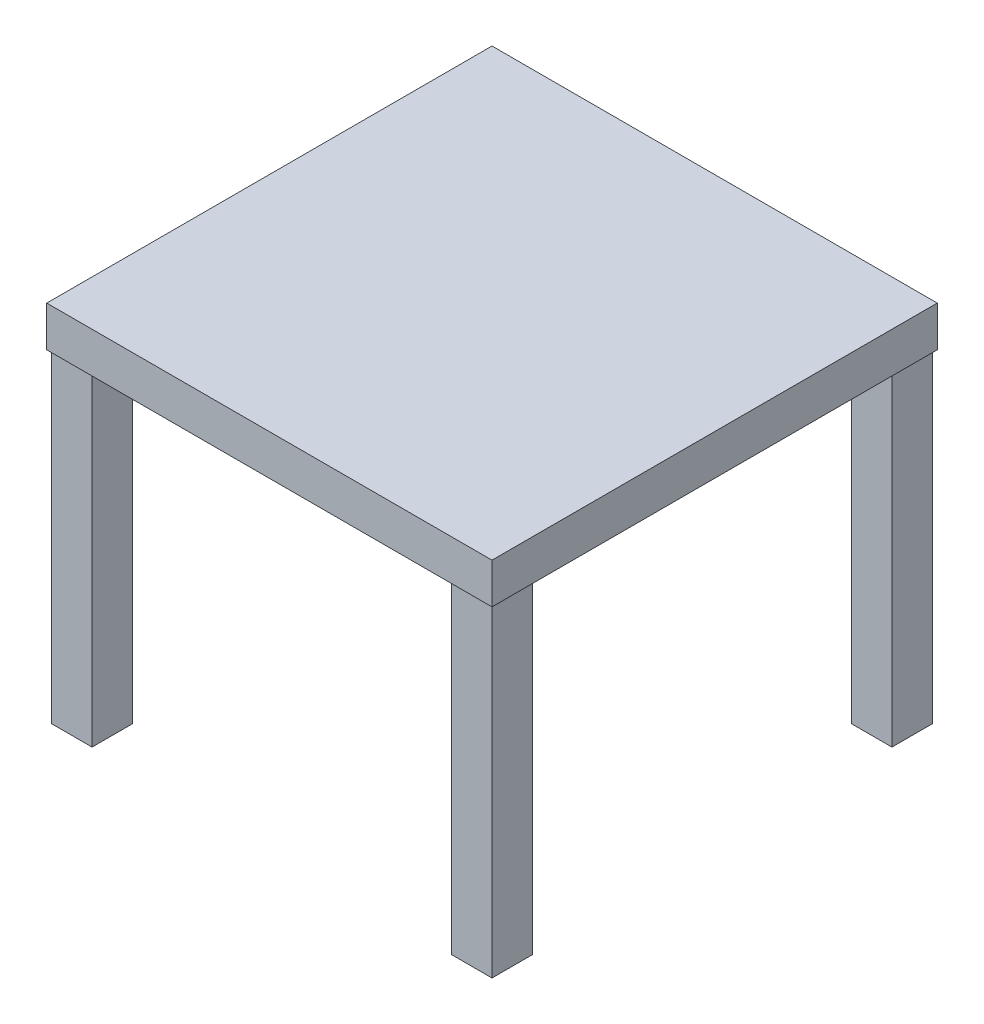
ISO-10303-21;
HEADER;
FILE_DESCRIPTION(('STEP AP214'),'2;1');
FILE_NAME('part.step','',(''),(''),'','','');
FILE_SCHEMA(('AUTOMOTIVE_DESIGN { 1 0 10303 214 1 1 1 1 }'));
ENDSEC;
DATA;
#1=APPLICATION_CONTEXT('core data for automotive mechanical design processes');
#2=APPLICATION_PROTOCOL_DEFINITION('international standard','automotive_design',2000,#1);
#3=PRODUCT_CONTEXT('',#1,'mechanical');
#4=PRODUCT('Part','Part','',(#3));
#5=PRODUCT_RELATED_PRODUCT_CATEGORY('part','',(#4));
#6=PRODUCT_DEFINITION_FORMATION('','',#4);
#7=PRODUCT_DEFINITION_CONTEXT('part definition',#1,'design');
#8=PRODUCT_DEFINITION('design','',#6,#7);
#9=PRODUCT_DEFINITION_SHAPE('','',#8);
#10=(LENGTH_UNIT() NAMED_UNIT(*) SI_UNIT(.MILLI.,.METRE.));
#11=(NAMED_UNIT(*) PLANE_ANGLE_UNIT() SI_UNIT($,.RADIAN.));
#12=(NAMED_UNIT(*) SI_UNIT($,.STERADIAN.) SOLID_ANGLE_UNIT());
#13=UNCERTAINTY_MEASURE_WITH_UNIT(LENGTH_MEASURE(1.E-05),#10,'distance_accuracy_value','');
#14=(GEOMETRIC_REPRESENTATION_CONTEXT(3) GLOBAL_UNCERTAINTY_ASSIGNED_CONTEXT((#13)) GLOBAL_UNIT_ASSIGNED_CONTEXT((#10,
#11,#12)) REPRESENTATION_CONTEXT('',''));
#15=CARTESIAN_POINT('',(0.,0.,0.));
#16=DIRECTION('',(0.,0.,1.));
#17=DIRECTION('',(1.,0.,0.));
#18=AXIS2_PLACEMENT_3D('',#15,#16,#17);
#19=CARTESIAN_POINT('',(-222.,0.,-222.));
#20=DIRECTION('',(0.,0.,1.));
#21=DIRECTION('',(1.,0.,0.));
#22=AXIS2_PLACEMENT_3D('',#19,#20,#21);
#23=PLANE('',#22);
#24=DIRECTION('',(1.,0.,0.));
#25=VECTOR('',#24,1.);
#26=CARTESIAN_POINT('',(-111.,0.,-222.));
#27=LINE('',#26,#25);
#28=CARTESIAN_POINT('',(-272.,0.,-222.));
#29=VERTEX_POINT('',#28);
#30=CARTESIAN_POINT('',(-222.,0.,-222.));
#31=VERTEX_POINT('',#30);
#32=EDGE_CURVE('E39',#29,#31,#27,.T.);
#33=ORIENTED_EDGE('',*,*,#32,.F.);
#34=DIRECTION('',(0.,-1.,0.));
#35=VECTOR('',#34,1.);
#36=CARTESIAN_POINT('',(-272.,0.,-222.));
#37=LINE('',#36,#35);
#38=CARTESIAN_POINT('',(-272.,-400.,-222.));
#39=VERTEX_POINT('',#38);
#40=EDGE_CURVE('E9',#29,#39,#37,.T.);
#41=ORIENTED_EDGE('',*,*,#40,.T.);
#42=DIRECTION('',(-1.,0.,0.));
#43=VECTOR('',#42,1.);
#44=CARTESIAN_POINT('',(-222.,-400.,-222.));
#45=LINE('',#44,#43);
#46=CARTESIAN_POINT('',(-222.,-400.,-222.));
#47=VERTEX_POINT('',#46);
#48=EDGE_CURVE('E306',#47,#39,#45,.T.);
#49=ORIENTED_EDGE('',*,*,#48,.F.);
#50=DIRECTION('',(0.,-1.,0.));
#51=VECTOR('',#50,1.);
#52=CARTESIAN_POINT('',(-222.,0.,-222.));
#53=LINE('',#52,#51);
#54=EDGE_CURVE('E26',#31,#47,#53,.T.);
#55=ORIENTED_EDGE('',*,*,#54,.F.);
#56=EDGE_LOOP('',(#33,#41,#49,#55));
#57=FACE_BOUND('',#56,.T.);
#58=ADVANCED_FACE('F15',(#57),#23,.T.);
#59=CARTESIAN_POINT('',(-222.,0.,-272.));
#60=DIRECTION('',(1.,0.,0.));
#61=DIRECTION('',(0.,1.,0.));
#62=AXIS2_PLACEMENT_3D('',#59,#60,#61);
#63=PLANE('',#62);
#64=DIRECTION('',(0.,0.,-1.));
#65=VECTOR('',#64,1.);
#66=CARTESIAN_POINT('',(-222.,0.,-136.));
#67=LINE('',#66,#65);
#68=CARTESIAN_POINT('',(-222.,0.,-272.));
#69=VERTEX_POINT('',#68);
#70=EDGE_CURVE('E271',#31,#69,#67,.T.);
#71=ORIENTED_EDGE('',*,*,#70,.F.);
#72=ORIENTED_EDGE('',*,*,#54,.T.);
#73=DIRECTION('',(0.,0.,1.));
#74=VECTOR('',#73,1.);
#75=CARTESIAN_POINT('',(-222.,-400.,-272.));
#76=LINE('',#75,#74);
#77=CARTESIAN_POINT('',(-222.,-400.,-272.));
#78=VERTEX_POINT('',#77);
#79=EDGE_CURVE('E301',#78,#47,#76,.T.);
#80=ORIENTED_EDGE('',*,*,#79,.F.);
#81=DIRECTION('',(0.,-1.,0.));
#82=VECTOR('',#81,1.);
#83=CARTESIAN_POINT('',(-222.,0.,-272.));
#84=LINE('',#83,#82);
#85=EDGE_CURVE('E256',#69,#78,#84,.T.);
#86=ORIENTED_EDGE('',*,*,#85,.F.);
#87=EDGE_LOOP('',(#71,#72,#80,#86));
#88=FACE_BOUND('',#87,.T.);
#89=ADVANCED_FACE('F445',(#88),#63,.T.);
#90=CARTESIAN_POINT('',(-272.,0.,-272.));
#91=DIRECTION('',(0.,0.,-1.));
#92=DIRECTION('',(0.,-1.,0.));
#93=AXIS2_PLACEMENT_3D('',#90,#91,#92);
#94=PLANE('',#93);
#95=DIRECTION('',(-1.,0.,0.));
#96=VECTOR('',#95,1.);
#97=CARTESIAN_POINT('',(-136.,0.,-272.));
#98=LINE('',#97,#96);
#99=CARTESIAN_POINT('',(-272.,0.,-272.));
#100=VERTEX_POINT('',#99);
#101=EDGE_CURVE('E349',#69,#100,#98,.T.);
#102=ORIENTED_EDGE('',*,*,#101,.F.);
#103=ORIENTED_EDGE('',*,*,#85,.T.);
#104=DIRECTION('',(1.,0.,0.));
#105=VECTOR('',#104,1.);
#106=CARTESIAN_POINT('',(-272.,-400.,-272.));
#107=LINE('',#106,#105);
#108=CARTESIAN_POINT('',(-272.,-400.,-272.));
#109=VERTEX_POINT('',#108);
#110=EDGE_CURVE('E305',#109,#78,#107,.T.);
#111=ORIENTED_EDGE('',*,*,#110,.F.);
#112=DIRECTION('',(0.,-1.,0.));
#113=VECTOR('',#112,1.);
#114=CARTESIAN_POINT('',(-272.,0.,-272.));
#115=LINE('',#114,#113);
#116=EDGE_CURVE('E260',#100,#109,#115,.T.);
#117=ORIENTED_EDGE('',*,*,#116,.F.);
#118=EDGE_LOOP('',(#102,#103,#111,#117));
#119=FACE_BOUND('',#118,.T.);
#120=ADVANCED_FACE('F450',(#119),#94,.T.);
#121=CARTESIAN_POINT('',(-272.,0.,-222.));
#122=DIRECTION('',(-1.,0.,0.));
#123=DIRECTION('',(0.,1.,0.));
#124=AXIS2_PLACEMENT_3D('',#121,#122,#123);
#125=PLANE('',#124);
#126=DIRECTION('',(0.,0.,1.));
#127=VECTOR('',#126,1.);
#128=CARTESIAN_POINT('',(-272.,0.,-111.));
#129=LINE('',#128,#127);
#130=EDGE_CURVE('E352',#100,#29,#129,.T.);
#131=ORIENTED_EDGE('',*,*,#130,.F.);
#132=ORIENTED_EDGE('',*,*,#116,.T.);
#133=DIRECTION('',(0.,0.,-1.));
#134=VECTOR('',#133,1.);
#135=CARTESIAN_POINT('',(-272.,-400.,-222.));
#136=LINE('',#135,#134);
#137=EDGE_CURVE('E361',#39,#109,#136,.T.);
#138=ORIENTED_EDGE('',*,*,#137,.F.);
#139=ORIENTED_EDGE('',*,*,#40,.F.);
#140=EDGE_LOOP('',(#131,#132,#138,#139));
#141=FACE_BOUND('',#140,.T.);
#142=ADVANCED_FACE('F490',(#141),#125,.T.);
#143=CARTESIAN_POINT('',(-247.,-400.,-247.));
#144=DIRECTION('',(0.,-1.,0.));
#145=DIRECTION('',(0.,0.,-1.));
#146=AXIS2_PLACEMENT_3D('',#143,#144,#145);
#147=PLANE('',#146);
#148=ORIENTED_EDGE('',*,*,#137,.T.);
#149=ORIENTED_EDGE('',*,*,#110,.T.);
#150=ORIENTED_EDGE('',*,*,#79,.T.);
#151=ORIENTED_EDGE('',*,*,#48,.T.);
#152=EDGE_LOOP('',(#148,#149,#150,#151));
#153=FACE_BOUND('',#152,.T.);
#154=ADVANCED_FACE('F495',(#153),#147,.T.);
#155=CARTESIAN_POINT('',(222.,0.,-222.));
#156=DIRECTION('',(-1.,0.,0.));
#157=DIRECTION('',(0.,0.,1.));
#158=AXIS2_PLACEMENT_3D('',#155,#156,#157);
#159=PLANE('',#158);
#160=DIRECTION('',(0.,0.,1.));
#161=VECTOR('',#160,1.);
#162=CARTESIAN_POINT('',(222.,0.,-111.));
#163=LINE('',#162,#161);
#164=CARTESIAN_POINT('',(222.,0.,-272.));
#165=VERTEX_POINT('',#164);
#166=CARTESIAN_POINT('',(222.,0.,-222.));
#167=VERTEX_POINT('',#166);
#168=EDGE_CURVE('E293',#165,#167,#163,.T.);
#169=ORIENTED_EDGE('',*,*,#168,.F.);
#170=DIRECTION('',(0.,-1.,0.));
#171=VECTOR('',#170,1.);
#172=CARTESIAN_POINT('',(222.,0.,-272.));
#173=LINE('',#172,#171);
#174=CARTESIAN_POINT('',(222.,-400.,-272.));
#175=VERTEX_POINT('',#174);
#176=EDGE_CURVE('E324',#165,#175,#173,.T.);
#177=ORIENTED_EDGE('',*,*,#176,.T.);
#178=DIRECTION('',(0.,0.,-1.));
#179=VECTOR('',#178,1.);
#180=CARTESIAN_POINT('',(222.,-400.,-222.));
#181=LINE('',#180,#179);
#182=CARTESIAN_POINT('',(222.,-400.,-222.));
#183=VERTEX_POINT('',#182);
#184=EDGE_CURVE('E279',#183,#175,#181,.T.);
#185=ORIENTED_EDGE('',*,*,#184,.F.);
#186=DIRECTION('',(0.,-1.,0.));
#187=VECTOR('',#186,1.);
#188=CARTESIAN_POINT('',(222.,0.,-222.));
#189=LINE('',#188,#187);
#190=EDGE_CURVE('E328',#167,#183,#189,.T.);
#191=ORIENTED_EDGE('',*,*,#190,.F.);
#192=EDGE_LOOP('',(#169,#177,#185,#191));
#193=FACE_BOUND('',#192,.T.);
#194=ADVANCED_FACE('F471',(#193),#159,.T.);
#195=CARTESIAN_POINT('',(272.,0.,-222.));
#196=DIRECTION('',(0.,0.,1.));
#197=DIRECTION('',(1.,0.,0.));
#198=AXIS2_PLACEMENT_3D('',#195,#196,#197);
#199=PLANE('',#198);
#200=DIRECTION('',(1.,0.,0.));
#201=VECTOR('',#200,1.);
#202=CARTESIAN_POINT('',(136.,0.,-222.));
#203=LINE('',#202,#201);
#204=CARTESIAN_POINT('',(272.,0.,-222.));
#205=VERTEX_POINT('',#204);
#206=EDGE_CURVE('E290',#167,#205,#203,.T.);
#207=ORIENTED_EDGE('',*,*,#206,.F.);
#208=ORIENTED_EDGE('',*,*,#190,.T.);
#209=DIRECTION('',(-1.,0.,0.));
#210=VECTOR('',#209,1.);
#211=CARTESIAN_POINT('',(272.,-400.,-222.));
#212=LINE('',#211,#210);
#213=CARTESIAN_POINT('',(272.,-400.,-222.));
#214=VERTEX_POINT('',#213);
#215=EDGE_CURVE('E275',#214,#183,#212,.T.);
#216=ORIENTED_EDGE('',*,*,#215,.F.);
#217=DIRECTION('',(0.,-1.,0.));
#218=VECTOR('',#217,1.);
#219=CARTESIAN_POINT('',(272.,0.,-222.));
#220=LINE('',#219,#218);
#221=EDGE_CURVE('E297',#205,#214,#220,.T.);
#222=ORIENTED_EDGE('',*,*,#221,.F.);
#223=EDGE_LOOP('',(#207,#208,#216,#222));
#224=FACE_BOUND('',#223,.T.);
#225=ADVANCED_FACE('F501',(#224),#199,.T.);
#226=CARTESIAN_POINT('',(272.,0.,-272.));
#227=DIRECTION('',(1.,0.,0.));
#228=DIRECTION('',(0.,1.,0.));
#229=AXIS2_PLACEMENT_3D('',#226,#227,#228);
#230=PLANE('',#229);
#231=DIRECTION('',(0.,0.,-1.));
#232=VECTOR('',#231,1.);
#233=CARTESIAN_POINT('',(272.,0.,-136.));
#234=LINE('',#233,#232);
#235=CARTESIAN_POINT('',(272.,0.,-272.));
#236=VERTEX_POINT('',#235);
#237=EDGE_CURVE('E268',#205,#236,#234,.T.);
#238=ORIENTED_EDGE('',*,*,#237,.F.);
#239=ORIENTED_EDGE('',*,*,#221,.T.);
#240=DIRECTION('',(0.,0.,1.));
#241=VECTOR('',#240,1.);
#242=CARTESIAN_POINT('',(272.,-400.,-272.));
#243=LINE('',#242,#241);
#244=CARTESIAN_POINT('',(272.,-400.,-272.));
#245=VERTEX_POINT('',#244);
#246=EDGE_CURVE('E250',#245,#214,#243,.T.);
#247=ORIENTED_EDGE('',*,*,#246,.F.);
#248=DIRECTION('',(0.,-1.,0.));
#249=VECTOR('',#248,1.);
#250=CARTESIAN_POINT('',(272.,0.,-272.));
#251=LINE('',#250,#249);
#252=EDGE_CURVE('E249',#236,#245,#251,.T.);
#253=ORIENTED_EDGE('',*,*,#252,.F.);
#254=EDGE_LOOP('',(#238,#239,#247,#253));
#255=FACE_BOUND('',#254,.T.);
#256=ADVANCED_FACE('F498',(#255),#230,.T.);
#257=CARTESIAN_POINT('',(222.,0.,-272.));
#258=DIRECTION('',(0.,0.,-1.));
#259=DIRECTION('',(-1.,0.,0.));
#260=AXIS2_PLACEMENT_3D('',#257,#258,#259);
#261=PLANE('',#260);
#262=DIRECTION('',(-1.,0.,0.));
#263=VECTOR('',#262,1.);
#264=CARTESIAN_POINT('',(111.,0.,-272.));
#265=LINE('',#264,#263);
#266=EDGE_CURVE('E264',#236,#165,#265,.T.);
#267=ORIENTED_EDGE('',*,*,#266,.F.);
#268=ORIENTED_EDGE('',*,*,#252,.T.);
#269=DIRECTION('',(1.,0.,0.));
#270=VECTOR('',#269,1.);
#271=CARTESIAN_POINT('',(222.,-400.,-272.));
#272=LINE('',#271,#270);
#273=EDGE_CURVE('E245',#175,#245,#272,.T.);
#274=ORIENTED_EDGE('',*,*,#273,.F.);
#275=ORIENTED_EDGE('',*,*,#176,.F.);
#276=EDGE_LOOP('',(#267,#268,#274,#275));
#277=FACE_BOUND('',#276,.T.);
#278=ADVANCED_FACE('F500',(#277),#261,.T.);
#279=CARTESIAN_POINT('',(247.,-400.,-247.));
#280=DIRECTION('',(0.,-1.,0.));
#281=DIRECTION('',(0.,0.,-1.));
#282=AXIS2_PLACEMENT_3D('',#279,#280,#281);
#283=PLANE('',#282);
#284=ORIENTED_EDGE('',*,*,#273,.T.);
#285=ORIENTED_EDGE('',*,*,#246,.T.);
#286=ORIENTED_EDGE('',*,*,#215,.T.);
#287=ORIENTED_EDGE('',*,*,#184,.T.);
#288=EDGE_LOOP('',(#284,#285,#286,#287));
#289=FACE_BOUND('',#288,.T.);
#290=ADVANCED_FACE('F507',(#289),#283,.T.);
#291=CARTESIAN_POINT('',(-222.,0.,222.));
#292=DIRECTION('',(1.,0.,0.));
#293=DIRECTION('',(0.,0.,1.));
#294=AXIS2_PLACEMENT_3D('',#291,#292,#293);
#295=PLANE('',#294);
#296=DIRECTION('',(0.,0.,-1.));
#297=VECTOR('',#296,1.);
#298=CARTESIAN_POINT('',(-222.,0.,111.));
#299=LINE('',#298,#297);
#300=CARTESIAN_POINT('',(-222.,0.,272.));
#301=VERTEX_POINT('',#300);
#302=CARTESIAN_POINT('',(-222.,0.,222.));
#303=VERTEX_POINT('',#302);
#304=EDGE_CURVE('E261',#301,#303,#299,.T.);
#305=ORIENTED_EDGE('',*,*,#304,.F.);
#306=DIRECTION('',(0.,-1.,0.));
#307=VECTOR('',#306,1.);
#308=CARTESIAN_POINT('',(-222.,0.,272.));
#309=LINE('',#308,#307);
#310=CARTESIAN_POINT('',(-222.,-400.,272.));
#311=VERTEX_POINT('',#310);
#312=EDGE_CURVE('E234',#301,#311,#309,.T.);
#313=ORIENTED_EDGE('',*,*,#312,.T.);
#314=DIRECTION('',(0.,0.,1.));
#315=VECTOR('',#314,1.);
#316=CARTESIAN_POINT('',(-222.,-400.,222.));
#317=LINE('',#316,#315);
#318=CARTESIAN_POINT('',(-222.,-400.,222.));
#319=VERTEX_POINT('',#318);
#320=EDGE_CURVE('E241',#319,#311,#317,.T.);
#321=ORIENTED_EDGE('',*,*,#320,.F.);
#322=DIRECTION('',(0.,-1.,0.));
#323=VECTOR('',#322,1.);
#324=CARTESIAN_POINT('',(-222.,0.,222.));
#325=LINE('',#324,#323);
#326=EDGE_CURVE('E230',#303,#319,#325,.T.);
#327=ORIENTED_EDGE('',*,*,#326,.F.);
#328=EDGE_LOOP('',(#305,#313,#321,#327));
#329=FACE_BOUND('',#328,.T.);
#330=ADVANCED_FACE('F564',(#329),#295,.T.);
#331=CARTESIAN_POINT('',(-272.,0.,222.));
#332=DIRECTION('',(0.,0.,-1.));
#333=DIRECTION('',(-1.,0.,0.));
#334=AXIS2_PLACEMENT_3D('',#331,#332,#333);
#335=PLANE('',#334);
#336=DIRECTION('',(-1.,0.,0.));
#337=VECTOR('',#336,1.);
#338=CARTESIAN_POINT('',(-136.,0.,222.));
#339=LINE('',#338,#337);
#340=CARTESIAN_POINT('',(-272.,0.,222.));
#341=VERTEX_POINT('',#340);
#342=EDGE_CURVE('E254',#303,#341,#339,.T.);
#343=ORIENTED_EDGE('',*,*,#342,.F.);
#344=ORIENTED_EDGE('',*,*,#326,.T.);
#345=DIRECTION('',(1.,0.,0.));
#346=VECTOR('',#345,1.);
#347=CARTESIAN_POINT('',(-272.,-400.,222.));
#348=LINE('',#347,#346);
#349=CARTESIAN_POINT('',(-272.,-400.,222.));
#350=VERTEX_POINT('',#349);
#351=EDGE_CURVE('E244',#350,#319,#348,.T.);
#352=ORIENTED_EDGE('',*,*,#351,.F.);
#353=DIRECTION('',(0.,-1.,0.));
#354=VECTOR('',#353,1.);
#355=CARTESIAN_POINT('',(-272.,0.,222.));
#356=LINE('',#355,#354);
#357=EDGE_CURVE('E235',#341,#350,#356,.T.);
#358=ORIENTED_EDGE('',*,*,#357,.F.);
#359=EDGE_LOOP('',(#343,#344,#352,#358));
#360=FACE_BOUND('',#359,.T.);
#361=ADVANCED_FACE('F573',(#360),#335,.T.);
#362=CARTESIAN_POINT('',(-272.,0.,272.));
#363=DIRECTION('',(-1.,0.,0.));
#364=DIRECTION('',(0.,0.,1.));
#365=AXIS2_PLACEMENT_3D('',#362,#363,#364);
#366=PLANE('',#365);
#367=DIRECTION('',(0.,0.,1.));
#368=VECTOR('',#367,1.);
#369=CARTESIAN_POINT('',(-272.,0.,136.));
#370=LINE('',#369,#368);
#371=CARTESIAN_POINT('',(-272.,0.,272.));
#372=VERTEX_POINT('',#371);
#373=EDGE_CURVE('E251',#341,#372,#370,.T.);
#374=ORIENTED_EDGE('',*,*,#373,.F.);
#375=ORIENTED_EDGE('',*,*,#357,.T.);
#376=DIRECTION('',(0.,0.,-1.));
#377=VECTOR('',#376,1.);
#378=CARTESIAN_POINT('',(-272.,-400.,272.));
#379=LINE('',#378,#377);
#380=CARTESIAN_POINT('',(-272.,-400.,272.));
#381=VERTEX_POINT('',#380);
#382=EDGE_CURVE('E312',#381,#350,#379,.T.);
#383=ORIENTED_EDGE('',*,*,#382,.F.);
#384=DIRECTION('',(0.,-1.,0.));
#385=VECTOR('',#384,1.);
#386=CARTESIAN_POINT('',(-272.,0.,272.));
#387=LINE('',#386,#385);
#388=EDGE_CURVE('E311',#372,#381,#387,.T.);
#389=ORIENTED_EDGE('',*,*,#388,.F.);
#390=EDGE_LOOP('',(#374,#375,#383,#389));
#391=FACE_BOUND('',#390,.T.);
#392=ADVANCED_FACE('F454',(#391),#366,.T.);
#393=CARTESIAN_POINT('',(-222.,0.,272.));
#394=DIRECTION('',(0.,0.,1.));
#395=DIRECTION('',(1.,0.,0.));
#396=AXIS2_PLACEMENT_3D('',#393,#394,#395);
#397=PLANE('',#396);
#398=DIRECTION('',(1.,0.,0.));
#399=VECTOR('',#398,1.);
#400=CARTESIAN_POINT('',(-111.,0.,272.));
#401=LINE('',#400,#399);
#402=EDGE_CURVE('E255',#372,#301,#401,.T.);
#403=ORIENTED_EDGE('',*,*,#402,.F.);
#404=ORIENTED_EDGE('',*,*,#388,.T.);
#405=DIRECTION('',(-1.,0.,0.));
#406=VECTOR('',#405,1.);
#407=CARTESIAN_POINT('',(-222.,-400.,272.));
#408=LINE('',#407,#406);
#409=EDGE_CURVE('E307',#311,#381,#408,.T.);
#410=ORIENTED_EDGE('',*,*,#409,.F.);
#411=ORIENTED_EDGE('',*,*,#312,.F.);
#412=EDGE_LOOP('',(#403,#404,#410,#411));
#413=FACE_BOUND('',#412,.T.);
#414=ADVANCED_FACE('F467',(#413),#397,.T.);
#415=CARTESIAN_POINT('',(-247.,-400.,247.));
#416=DIRECTION('',(0.,-1.,0.));
#417=DIRECTION('',(0.,0.,-1.));
#418=AXIS2_PLACEMENT_3D('',#415,#416,#417);
#419=PLANE('',#418);
#420=ORIENTED_EDGE('',*,*,#409,.T.);
#421=ORIENTED_EDGE('',*,*,#382,.T.);
#422=ORIENTED_EDGE('',*,*,#351,.T.);
#423=ORIENTED_EDGE('',*,*,#320,.T.);
#424=EDGE_LOOP('',(#420,#421,#422,#423));
#425=FACE_BOUND('',#424,.T.);
#426=ADVANCED_FACE('F462',(#425),#419,.T.);
#427=CARTESIAN_POINT('',(222.,0.,222.));
#428=DIRECTION('',(0.,0.,-1.));
#429=DIRECTION('',(0.,-1.,0.));
#430=AXIS2_PLACEMENT_3D('',#427,#428,#429);
#431=PLANE('',#430);
#432=DIRECTION('',(-1.,0.,0.));
#433=VECTOR('',#432,1.);
#434=CARTESIAN_POINT('',(111.,0.,222.));
#435=LINE('',#434,#433);
#436=CARTESIAN_POINT('',(272.,0.,222.));
#437=VERTEX_POINT('',#436);
#438=CARTESIAN_POINT('',(222.,0.,222.));
#439=VERTEX_POINT('',#438);
#440=EDGE_CURVE('E239',#437,#439,#435,.T.);
#441=ORIENTED_EDGE('',*,*,#440,.F.);
#442=DIRECTION('',(0.,-1.,0.));
#443=VECTOR('',#442,1.);
#444=CARTESIAN_POINT('',(272.,0.,222.));
#445=LINE('',#444,#443);
#446=CARTESIAN_POINT('',(272.,-400.,222.));
#447=VERTEX_POINT('',#446);
#448=EDGE_CURVE('E19',#437,#447,#445,.T.);
#449=ORIENTED_EDGE('',*,*,#448,.T.);
#450=DIRECTION('',(1.,0.,0.));
#451=VECTOR('',#450,1.);
#452=CARTESIAN_POINT('',(222.,-400.,222.));
#453=LINE('',#452,#451);
#454=CARTESIAN_POINT('',(222.,-400.,222.));
#455=VERTEX_POINT('',#454);
#456=EDGE_CURVE('E212',#455,#447,#453,.T.);
#457=ORIENTED_EDGE('',*,*,#456,.F.);
#458=DIRECTION('',(0.,-1.,0.));
#459=VECTOR('',#458,1.);
#460=CARTESIAN_POINT('',(222.,0.,222.));
#461=LINE('',#460,#459);
#462=EDGE_CURVE('E338',#439,#455,#461,.T.);
#463=ORIENTED_EDGE('',*,*,#462,.F.);
#464=EDGE_LOOP('',(#441,#449,#457,#463));
#465=FACE_BOUND('',#464,.T.);
#466=ADVANCED_FACE('F421',(#465),#431,.T.);
#467=CARTESIAN_POINT('',(222.,0.,272.));
#468=DIRECTION('',(-1.,0.,0.));
#469=DIRECTION('',(0.,1.,0.));
#470=AXIS2_PLACEMENT_3D('',#467,#468,#469);
#471=PLANE('',#470);
#472=DIRECTION('',(0.,0.,1.));
#473=VECTOR('',#472,1.);
#474=CARTESIAN_POINT('',(222.,0.,136.));
#475=LINE('',#474,#473);
#476=CARTESIAN_POINT('',(222.,0.,272.));
#477=VERTEX_POINT('',#476);
#478=EDGE_CURVE('E236',#439,#477,#475,.T.);
#479=ORIENTED_EDGE('',*,*,#478,.F.);
#480=ORIENTED_EDGE('',*,*,#462,.T.);
#481=DIRECTION('',(0.,0.,-1.));
#482=VECTOR('',#481,1.);
#483=CARTESIAN_POINT('',(222.,-400.,272.));
#484=LINE('',#483,#482);
#485=CARTESIAN_POINT('',(222.,-400.,272.));
#486=VERTEX_POINT('',#485);
#487=EDGE_CURVE('E348',#486,#455,#484,.T.);
#488=ORIENTED_EDGE('',*,*,#487,.F.);
#489=DIRECTION('',(0.,-1.,0.));
#490=VECTOR('',#489,1.);
#491=CARTESIAN_POINT('',(222.,0.,272.));
#492=LINE('',#491,#490);
#493=EDGE_CURVE('E334',#477,#486,#492,.T.);
#494=ORIENTED_EDGE('',*,*,#493,.F.);
#495=EDGE_LOOP('',(#479,#480,#488,#494));
#496=FACE_BOUND('',#495,.T.);
#497=ADVANCED_FACE('F432',(#496),#471,.T.);
#498=CARTESIAN_POINT('',(272.,0.,272.));
#499=DIRECTION('',(0.,0.,1.));
#500=DIRECTION('',(1.,0.,0.));
#501=AXIS2_PLACEMENT_3D('',#498,#499,#500);
#502=PLANE('',#501);
#503=DIRECTION('',(1.,0.,0.));
#504=VECTOR('',#503,1.);
#505=CARTESIAN_POINT('',(136.,0.,272.));
#506=LINE('',#505,#504);
#507=CARTESIAN_POINT('',(272.,0.,272.));
#508=VERTEX_POINT('',#507);
#509=EDGE_CURVE('E240',#477,#508,#506,.T.);
#510=ORIENTED_EDGE('',*,*,#509,.F.);
#511=ORIENTED_EDGE('',*,*,#493,.T.);
#512=DIRECTION('',(-1.,0.,0.));
#513=VECTOR('',#512,1.);
#514=CARTESIAN_POINT('',(272.,-400.,272.));
#515=LINE('',#514,#513);
#516=CARTESIAN_POINT('',(272.,-400.,272.));
#517=VERTEX_POINT('',#516);
#518=EDGE_CURVE('E344',#517,#486,#515,.T.);
#519=ORIENTED_EDGE('',*,*,#518,.F.);
#520=DIRECTION('',(0.,-1.,0.));
#521=VECTOR('',#520,1.);
#522=CARTESIAN_POINT('',(272.,0.,272.));
#523=LINE('',#522,#521);
#524=EDGE_CURVE('E339',#508,#517,#523,.T.);
#525=ORIENTED_EDGE('',*,*,#524,.F.);
#526=EDGE_LOOP('',(#510,#511,#519,#525));
#527=FACE_BOUND('',#526,.T.);
#528=ADVANCED_FACE('F428',(#527),#502,.T.);
#529=CARTESIAN_POINT('',(272.,0.,222.));
#530=DIRECTION('',(1.,0.,0.));
#531=DIRECTION('',(0.,0.,-1.));
#532=AXIS2_PLACEMENT_3D('',#529,#530,#531);
#533=PLANE('',#532);
#534=DIRECTION('',(0.,0.,-1.));
#535=VECTOR('',#534,1.);
#536=CARTESIAN_POINT('',(272.,0.,111.));
#537=LINE('',#536,#535);
#538=EDGE_CURVE('E323',#508,#437,#537,.T.);
#539=ORIENTED_EDGE('',*,*,#538,.F.);
#540=ORIENTED_EDGE('',*,*,#524,.T.);
#541=DIRECTION('',(0.,0.,1.));
#542=VECTOR('',#541,1.);
#543=CARTESIAN_POINT('',(272.,-400.,222.));
#544=LINE('',#543,#542);
#545=EDGE_CURVE('E343',#447,#517,#544,.T.);
#546=ORIENTED_EDGE('',*,*,#545,.F.);
#547=ORIENTED_EDGE('',*,*,#448,.F.);
#548=EDGE_LOOP('',(#539,#540,#546,#547));
#549=FACE_BOUND('',#548,.T.);
#550=ADVANCED_FACE('F424',(#549),#533,.T.);
#551=CARTESIAN_POINT('',(247.,-400.,247.));
#552=DIRECTION('',(0.,-1.,0.));
#553=DIRECTION('',(0.,0.,-1.));
#554=AXIS2_PLACEMENT_3D('',#551,#552,#553);
#555=PLANE('',#554);
#556=ORIENTED_EDGE('',*,*,#545,.T.);
#557=ORIENTED_EDGE('',*,*,#518,.T.);
#558=ORIENTED_EDGE('',*,*,#487,.T.);
#559=ORIENTED_EDGE('',*,*,#456,.T.);
#560=EDGE_LOOP('',(#556,#557,#558,#559));
#561=FACE_BOUND('',#560,.T.);
#562=ADVANCED_FACE('F416',(#561),#555,.T.);
#563=CARTESIAN_POINT('',(275.,0.,275.));
#564=DIRECTION('',(1.,0.,0.));
#565=DIRECTION('',(0.,1.,0.));
#566=AXIS2_PLACEMENT_3D('',#563,#564,#565);
#567=PLANE('',#566);
#568=DIRECTION('',(0.,0.,1.));
#569=VECTOR('',#568,1.);
#570=CARTESIAN_POINT('',(275.,0.,-275.));
#571=LINE('',#570,#569);
#572=CARTESIAN_POINT('',(275.,0.,-275.));
#573=VERTEX_POINT('',#572);
#574=CARTESIAN_POINT('',(275.,0.,275.));
#575=VERTEX_POINT('',#574);
#576=EDGE_CURVE('E191',#573,#575,#571,.T.);
#577=ORIENTED_EDGE('',*,*,#576,.F.);
#578=DIRECTION('',(0.,1.,0.));
#579=VECTOR('',#578,1.);
#580=CARTESIAN_POINT('',(275.,0.,-275.));
#581=LINE('',#580,#579);
#582=CARTESIAN_POINT('',(275.,50.,-275.));
#583=VERTEX_POINT('',#582);
#584=EDGE_CURVE('E194',#573,#583,#581,.T.);
#585=ORIENTED_EDGE('',*,*,#584,.T.);
#586=DIRECTION('',(0.,0.,-1.));
#587=VECTOR('',#586,1.);
#588=CARTESIAN_POINT('',(275.,50.,-275.));
#589=LINE('',#588,#587);
#590=CARTESIAN_POINT('',(275.,50.,275.));
#591=VERTEX_POINT('',#590);
#592=EDGE_CURVE('E184',#591,#583,#589,.T.);
#593=ORIENTED_EDGE('',*,*,#592,.F.);
#594=DIRECTION('',(0.,1.,0.));
#595=VECTOR('',#594,1.);
#596=CARTESIAN_POINT('',(275.,0.,275.));
#597=LINE('',#596,#595);
#598=EDGE_CURVE('E197',#575,#591,#597,.T.);
#599=ORIENTED_EDGE('',*,*,#598,.F.);
#600=EDGE_LOOP('',(#577,#585,#593,#599));
#601=FACE_BOUND('',#600,.T.);
#602=ADVANCED_FACE('F193',(#601),#567,.T.);
#603=CARTESIAN_POINT('',(-275.,0.,275.));
#604=DIRECTION('',(0.,0.,1.));
#605=DIRECTION('',(1.,0.,0.));
#606=AXIS2_PLACEMENT_3D('',#603,#604,#605);
#607=PLANE('',#606);
#608=DIRECTION('',(-1.,0.,0.));
#609=VECTOR('',#608,1.);
#610=CARTESIAN_POINT('',(275.,0.,275.));
#611=LINE('',#610,#609);
#612=CARTESIAN_POINT('',(-275.,0.,275.));
#613=VERTEX_POINT('',#612);
#614=EDGE_CURVE('E204',#575,#613,#611,.T.);
#615=ORIENTED_EDGE('',*,*,#614,.F.);
#616=ORIENTED_EDGE('',*,*,#598,.T.);
#617=DIRECTION('',(1.,0.,0.));
#618=VECTOR('',#617,1.);
#619=CARTESIAN_POINT('',(275.,50.,275.));
#620=LINE('',#619,#618);
#621=CARTESIAN_POINT('',(-275.,50.,275.));
#622=VERTEX_POINT('',#621);
#623=EDGE_CURVE('E225',#622,#591,#620,.T.);
#624=ORIENTED_EDGE('',*,*,#623,.F.);
#625=DIRECTION('',(0.,1.,0.));
#626=VECTOR('',#625,1.);
#627=CARTESIAN_POINT('',(-275.,0.,275.));
#628=LINE('',#627,#626);
#629=EDGE_CURVE('E274',#613,#622,#628,.T.);
#630=ORIENTED_EDGE('',*,*,#629,.F.);
#631=EDGE_LOOP('',(#615,#616,#624,#630));
#632=FACE_BOUND('',#631,.T.);
#633=ADVANCED_FACE('F17',(#632),#607,.T.);
#634=CARTESIAN_POINT('',(-275.,0.,-275.));
#635=DIRECTION('',(-1.,0.,0.));
#636=DIRECTION('',(0.,0.,1.));
#637=AXIS2_PLACEMENT_3D('',#634,#635,#636);
#638=PLANE('',#637);
#639=DIRECTION('',(0.,0.,-1.));
#640=VECTOR('',#639,1.);
#641=CARTESIAN_POINT('',(-275.,0.,275.));
#642=LINE('',#641,#640);
#643=CARTESIAN_POINT('',(-275.,0.,-275.));
#644=VERTEX_POINT('',#643);
#645=EDGE_CURVE('E218',#613,#644,#642,.T.);
#646=ORIENTED_EDGE('',*,*,#645,.F.);
#647=ORIENTED_EDGE('',*,*,#629,.T.);
#648=DIRECTION('',(0.,0.,1.));
#649=VECTOR('',#648,1.);
#650=CARTESIAN_POINT('',(-275.,50.,275.));
#651=LINE('',#650,#649);
#652=CARTESIAN_POINT('',(-275.,50.,-275.));
#653=VERTEX_POINT('',#652);
#654=EDGE_CURVE('E229',#653,#622,#651,.T.);
#655=ORIENTED_EDGE('',*,*,#654,.F.);
#656=DIRECTION('',(0.,1.,0.));
#657=VECTOR('',#656,1.);
#658=CARTESIAN_POINT('',(-275.,0.,-275.));
#659=LINE('',#658,#657);
#660=EDGE_CURVE('E280',#644,#653,#659,.T.);
#661=ORIENTED_EDGE('',*,*,#660,.F.);
#662=EDGE_LOOP('',(#646,#647,#655,#661));
#663=FACE_BOUND('',#662,.T.);
#664=ADVANCED_FACE('F474',(#663),#638,.T.);
#665=CARTESIAN_POINT('',(275.,0.,-275.));
#666=DIRECTION('',(0.,0.,-1.));
#667=DIRECTION('',(0.,-1.,0.));
#668=AXIS2_PLACEMENT_3D('',#665,#666,#667);
#669=PLANE('',#668);
#670=DIRECTION('',(1.,0.,0.));
#671=VECTOR('',#670,1.);
#672=CARTESIAN_POINT('',(-275.,0.,-275.));
#673=LINE('',#672,#671);
#674=EDGE_CURVE('E203',#644,#573,#673,.T.);
#675=ORIENTED_EDGE('',*,*,#674,.F.);
#676=ORIENTED_EDGE('',*,*,#660,.T.);
#677=DIRECTION('',(-1.,0.,0.));
#678=VECTOR('',#677,1.);
#679=CARTESIAN_POINT('',(-275.,50.,-275.));
#680=LINE('',#679,#678);
#681=EDGE_CURVE('E210',#583,#653,#680,.T.);
#682=ORIENTED_EDGE('',*,*,#681,.F.);
#683=ORIENTED_EDGE('',*,*,#584,.F.);
#684=EDGE_LOOP('',(#675,#676,#682,#683));
#685=FACE_BOUND('',#684,.T.);
#686=ADVANCED_FACE('F208',(#685),#669,.T.);
#687=CARTESIAN_POINT('',(0.,50.,0.));
#688=DIRECTION('',(0.,1.,0.));
#689=DIRECTION('',(1.,0.,0.));
#690=AXIS2_PLACEMENT_3D('',#687,#688,#689);
#691=PLANE('',#690);
#692=ORIENTED_EDGE('',*,*,#681,.T.);
#693=ORIENTED_EDGE('',*,*,#654,.T.);
#694=ORIENTED_EDGE('',*,*,#623,.T.);
#695=ORIENTED_EDGE('',*,*,#592,.T.);
#696=EDGE_LOOP('',(#692,#693,#694,#695));
#697=FACE_BOUND('',#696,.T.);
#698=ADVANCED_FACE('F435',(#697),#691,.T.);
#699=CARTESIAN_POINT('',(0.,0.,0.));
#700=DIRECTION('',(0.,1.,0.));
#701=DIRECTION('',(1.,0.,0.));
#702=AXIS2_PLACEMENT_3D('',#699,#700,#701);
#703=PLANE('',#702);
#704=ORIENTED_EDGE('',*,*,#674,.T.);
#705=ORIENTED_EDGE('',*,*,#576,.T.);
#706=ORIENTED_EDGE('',*,*,#614,.T.);
#707=ORIENTED_EDGE('',*,*,#645,.T.);
#708=EDGE_LOOP('',(#704,#705,#706,#707));
#709=FACE_BOUND('',#708,.T.);
#710=ORIENTED_EDGE('',*,*,#32,.T.);
#711=ORIENTED_EDGE('',*,*,#70,.T.);
#712=ORIENTED_EDGE('',*,*,#101,.T.);
#713=ORIENTED_EDGE('',*,*,#130,.T.);
#714=EDGE_LOOP('',(#710,#711,#712,#713));
#715=FACE_BOUND('',#714,.T.);
#716=ORIENTED_EDGE('',*,*,#168,.T.);
#717=ORIENTED_EDGE('',*,*,#206,.T.);
#718=ORIENTED_EDGE('',*,*,#237,.T.);
#719=ORIENTED_EDGE('',*,*,#266,.T.);
#720=EDGE_LOOP('',(#716,#717,#718,#719));
#721=FACE_BOUND('',#720,.T.);
#722=ORIENTED_EDGE('',*,*,#304,.T.);
#723=ORIENTED_EDGE('',*,*,#342,.T.);
#724=ORIENTED_EDGE('',*,*,#373,.T.);
#725=ORIENTED_EDGE('',*,*,#402,.T.);
#726=EDGE_LOOP('',(#722,#723,#724,#725));
#727=FACE_BOUND('',#726,.T.);
#728=ORIENTED_EDGE('',*,*,#440,.T.);
#729=ORIENTED_EDGE('',*,*,#478,.T.);
#730=ORIENTED_EDGE('',*,*,#509,.T.);
#731=ORIENTED_EDGE('',*,*,#538,.T.);
#732=EDGE_LOOP('',(#728,#729,#730,#731));
#733=FACE_BOUND('',#732,.T.);
#734=ADVANCED_FACE('F215',(#709,#715,#721,#727,#733),#703,.F.);
#735=CLOSED_SHELL('',(#58,#89,#120,#142,#154,#194,#225,#256,#278,#290,#330,#361,#392,#414,#426,
#466,#497,#528,#550,#562,#602,#633,#664,#686,#698,#734));
#736=MANIFOLD_SOLID_BREP('B1',#735);
#737=ADVANCED_BREP_SHAPE_REPRESENTATION('',(#18,#736),#14);
#738=SHAPE_DEFINITION_REPRESENTATION(#9,#737);
ENDSEC;
END-ISO-10303-21;
